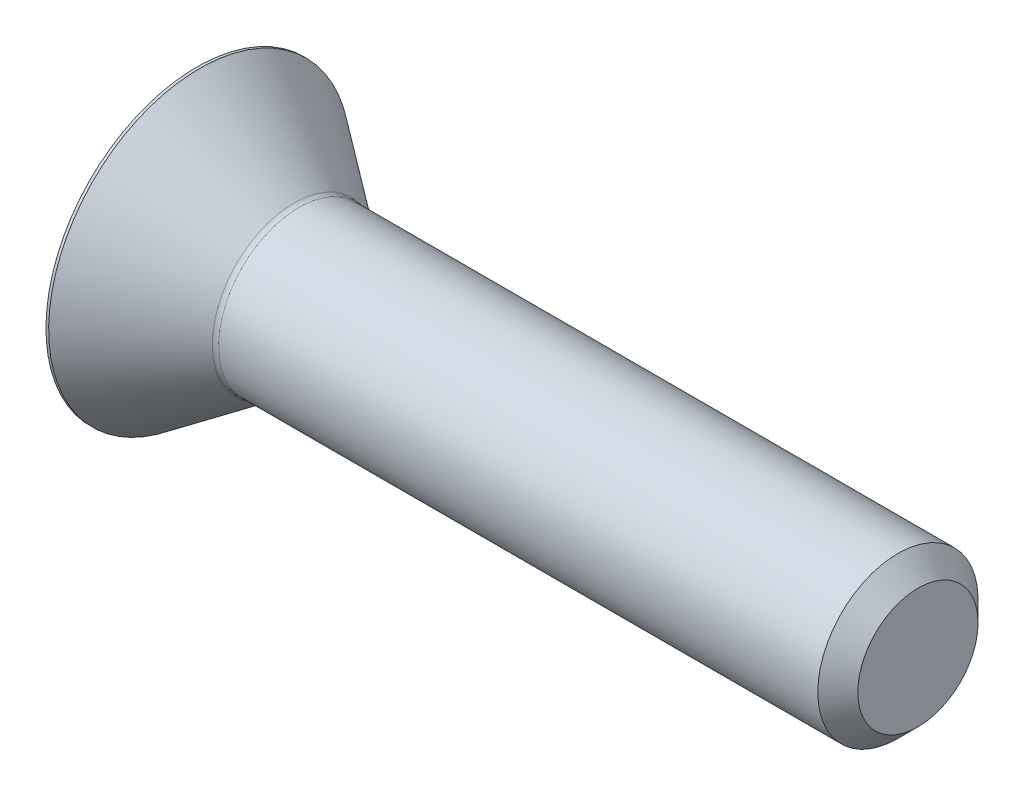
ISO-10303-21;
HEADER;
FILE_DESCRIPTION(('STEP AP214'),'2;1');
FILE_NAME('part.step','',(''),(''),'','','');
FILE_SCHEMA(('AUTOMOTIVE_DESIGN { 1 0 10303 214 1 1 1 1 }'));
ENDSEC;
DATA;
#1=APPLICATION_CONTEXT('core data for automotive mechanical design processes');
#2=APPLICATION_PROTOCOL_DEFINITION('international standard','automotive_design',2000,#1);
#3=PRODUCT_CONTEXT('',#1,'mechanical');
#4=PRODUCT('Part','Part','',(#3));
#5=PRODUCT_RELATED_PRODUCT_CATEGORY('part','',(#4));
#6=PRODUCT_DEFINITION_FORMATION('','',#4);
#7=PRODUCT_DEFINITION_CONTEXT('part definition',#1,'design');
#8=PRODUCT_DEFINITION('design','',#6,#7);
#9=PRODUCT_DEFINITION_SHAPE('','',#8);
#10=(LENGTH_UNIT() NAMED_UNIT(*) SI_UNIT(.MILLI.,.METRE.));
#11=(NAMED_UNIT(*) PLANE_ANGLE_UNIT() SI_UNIT($,.RADIAN.));
#12=(NAMED_UNIT(*) SI_UNIT($,.STERADIAN.) SOLID_ANGLE_UNIT());
#13=UNCERTAINTY_MEASURE_WITH_UNIT(LENGTH_MEASURE(1.E-05),#10,'distance_accuracy_value','');
#14=(GEOMETRIC_REPRESENTATION_CONTEXT(3) GLOBAL_UNCERTAINTY_ASSIGNED_CONTEXT((#13)) GLOBAL_UNIT_ASSIGNED_CONTEXT((#10,
#11,#12)) REPRESENTATION_CONTEXT('',''));
#15=CARTESIAN_POINT('',(0.,0.,0.));
#16=DIRECTION('',(0.,0.,1.));
#17=DIRECTION('',(1.,0.,0.));
#18=AXIS2_PLACEMENT_3D('',#15,#16,#17);
#19=CARTESIAN_POINT('',(1.50000000007822,0.,0.));
#20=DIRECTION('',(-1.,0.,0.));
#21=DIRECTION('',(0.,0.,1.));
#22=AXIS2_PLACEMENT_3D('',#19,#20,#21);
#23=CONICAL_SURFACE('',#22,1.43649999989748,1.04719755095507);
#24=CARTESIAN_POINT('',(2.32936366182912,0.,0.));
#25=VERTEX_POINT('',#24);
#26=VERTEX_LOOP('',#25);
#27=FACE_BOUND('',#26,.T.);
#28=CARTESIAN_POINT('',(1.50000000001258,0.,0.));
#29=DIRECTION('',(-1.,0.,0.));
#30=DIRECTION('',(0.,0.,1.));
#31=AXIS2_PLACEMENT_3D('',#28,#29,#30);
#32=CIRCLE('',#31,1.43650000001117);
#33=CARTESIAN_POINT('',(1.50000000001258,1.43650000001117,0.));
#34=VERTEX_POINT('',#33);
#35=CARTESIAN_POINT('',(1.50000000001258,0.718250000005584,-1.24404549254601));
#36=VERTEX_POINT('',#35);
#37=EDGE_CURVE('E133',#34,#36,#32,.T.);
#38=ORIENTED_EDGE('',*,*,#37,.T.);
#39=CARTESIAN_POINT('',(1.50000000001258,0.,0.));
#40=DIRECTION('',(-1.,0.,0.));
#41=DIRECTION('',(0.,0.,1.));
#42=AXIS2_PLACEMENT_3D('',#39,#40,#41);
#43=CIRCLE('',#42,1.43650000001116);
#44=CARTESIAN_POINT('',(1.50000000001258,-0.718250000005581,-1.24404549254602));
#45=VERTEX_POINT('',#44);
#46=EDGE_CURVE('E131',#36,#45,#43,.T.);
#47=ORIENTED_EDGE('',*,*,#46,.T.);
#48=CARTESIAN_POINT('',(1.50000000001258,0.,0.));
#49=DIRECTION('',(-1.,0.,0.));
#50=DIRECTION('',(0.,0.,1.));
#51=AXIS2_PLACEMENT_3D('',#48,#49,#50);
#52=CIRCLE('',#51,1.43650000001116);
#53=CARTESIAN_POINT('',(1.50000000001698,-1.43649999999987,-2.15376761564245E-13));
#54=VERTEX_POINT('',#53);
#55=EDGE_CURVE('E75',#45,#54,#52,.T.);
#56=ORIENTED_EDGE('',*,*,#55,.T.);
#57=CARTESIAN_POINT('',(1.50000000001258,0.,0.));
#58=DIRECTION('',(-1.,0.,0.));
#59=DIRECTION('',(0.,0.,1.));
#60=AXIS2_PLACEMENT_3D('',#57,#58,#59);
#61=CIRCLE('',#60,1.43650000001116);
#62=CARTESIAN_POINT('',(1.50000000001258,-0.718250000005582,1.24404549254602));
#63=VERTEX_POINT('',#62);
#64=EDGE_CURVE('E20',#54,#63,#61,.T.);
#65=ORIENTED_EDGE('',*,*,#64,.T.);
#66=CARTESIAN_POINT('',(1.50000000001258,0.,0.));
#67=DIRECTION('',(-1.,0.,0.));
#68=DIRECTION('',(0.,0.,1.));
#69=AXIS2_PLACEMENT_3D('',#66,#67,#68);
#70=CIRCLE('',#69,1.43650000001116);
#71=CARTESIAN_POINT('',(1.50000000001258,0.718250000005582,1.24404549254602));
#72=VERTEX_POINT('',#71);
#73=EDGE_CURVE('E72',#63,#72,#70,.T.);
#74=ORIENTED_EDGE('',*,*,#73,.T.);
#75=CARTESIAN_POINT('',(1.50000000001258,0.,0.));
#76=DIRECTION('',(-1.,0.,0.));
#77=DIRECTION('',(0.,0.,1.));
#78=AXIS2_PLACEMENT_3D('',#75,#76,#77);
#79=CIRCLE('',#78,1.43650000001116);
#80=EDGE_CURVE('E99',#72,#34,#79,.T.);
#81=ORIENTED_EDGE('',*,*,#80,.T.);
#82=EDGE_LOOP('',(#38,#47,#56,#65,#74,#81));
#83=FACE_BOUND('',#82,.T.);
#84=ADVANCED_FACE('F16',(#27,#83),#23,.F.);
#85=CARTESIAN_POINT('',(1.5,0.,0.));
#86=DIRECTION('',(-1.,0.,0.));
#87=DIRECTION('',(0.,-1.,0.));
#88=AXIS2_PLACEMENT_3D('',#85,#86,#87);
#89=PLANE('',#88);
#90=DIRECTION('',(0.,-0.5,-0.866025403784438));
#91=VECTOR('',#90,1.);
#92=CARTESIAN_POINT('',(1.50000000002137,-1.4365,0.));
#93=LINE('',#92,#91);
#94=EDGE_CURVE('E79',#54,#63,#93,.F.);
#95=ORIENTED_EDGE('',*,*,#94,.T.);
#96=ORIENTED_EDGE('',*,*,#64,.F.);
#97=EDGE_LOOP('',(#95,#96));
#98=FACE_BOUND('',#97,.T.);
#99=ADVANCED_FACE('F81',(#98),#89,.F.);
#100=CARTESIAN_POINT('',(1.5,0.,0.));
#101=DIRECTION('',(-1.,0.,0.));
#102=DIRECTION('',(0.,-1.,0.));
#103=AXIS2_PLACEMENT_3D('',#100,#101,#102);
#104=PLANE('',#103);
#105=DIRECTION('',(0.,-1.,0.));
#106=VECTOR('',#105,1.);
#107=CARTESIAN_POINT('',(1.50000000002137,-0.718249999999999,1.24404549253635));
#108=LINE('',#107,#106);
#109=EDGE_CURVE('E94',#63,#72,#108,.F.);
#110=ORIENTED_EDGE('',*,*,#109,.T.);
#111=ORIENTED_EDGE('',*,*,#73,.F.);
#112=EDGE_LOOP('',(#110,#111));
#113=FACE_BOUND('',#112,.T.);
#114=ADVANCED_FACE('F97',(#113),#104,.F.);
#115=CARTESIAN_POINT('',(1.5,0.,0.));
#116=DIRECTION('',(-1.,0.,0.));
#117=DIRECTION('',(0.,-1.,0.));
#118=AXIS2_PLACEMENT_3D('',#115,#116,#117);
#119=PLANE('',#118);
#120=DIRECTION('',(0.,-0.5,0.866025403784439));
#121=VECTOR('',#120,1.);
#122=CARTESIAN_POINT('',(1.50000000002137,0.71825,1.24404549253635));
#123=LINE('',#122,#121);
#124=EDGE_CURVE('E105',#72,#34,#123,.F.);
#125=ORIENTED_EDGE('',*,*,#124,.T.);
#126=ORIENTED_EDGE('',*,*,#80,.F.);
#127=EDGE_LOOP('',(#125,#126));
#128=FACE_BOUND('',#127,.T.);
#129=ADVANCED_FACE('F141',(#128),#119,.F.);
#130=CARTESIAN_POINT('',(1.5,0.,0.));
#131=DIRECTION('',(-1.,0.,0.));
#132=DIRECTION('',(0.,-1.,0.));
#133=AXIS2_PLACEMENT_3D('',#130,#131,#132);
#134=PLANE('',#133);
#135=DIRECTION('',(0.,0.499999999999999,0.866025403784439));
#136=VECTOR('',#135,1.);
#137=CARTESIAN_POINT('',(1.50000000002137,1.4365,0.));
#138=LINE('',#137,#136);
#139=EDGE_CURVE('E151',#34,#36,#138,.F.);
#140=ORIENTED_EDGE('',*,*,#139,.T.);
#141=ORIENTED_EDGE('',*,*,#37,.F.);
#142=EDGE_LOOP('',(#140,#141));
#143=FACE_BOUND('',#142,.T.);
#144=ADVANCED_FACE('F154',(#143),#134,.F.);
#145=CARTESIAN_POINT('',(1.5,0.,0.));
#146=DIRECTION('',(-1.,0.,0.));
#147=DIRECTION('',(0.,-1.,0.));
#148=AXIS2_PLACEMENT_3D('',#145,#146,#147);
#149=PLANE('',#148);
#150=DIRECTION('',(0.,1.,0.));
#151=VECTOR('',#150,1.);
#152=CARTESIAN_POINT('',(1.50000000002137,0.718250000000002,-1.24404549253635));
#153=LINE('',#152,#151);
#154=EDGE_CURVE('E160',#36,#45,#153,.F.);
#155=ORIENTED_EDGE('',*,*,#154,.T.);
#156=ORIENTED_EDGE('',*,*,#46,.F.);
#157=EDGE_LOOP('',(#155,#156));
#158=FACE_BOUND('',#157,.T.);
#159=ADVANCED_FACE('F313',(#158),#149,.F.);
#160=CARTESIAN_POINT('',(1.5,0.,0.));
#161=DIRECTION('',(-1.,0.,0.));
#162=DIRECTION('',(0.,-1.,0.));
#163=AXIS2_PLACEMENT_3D('',#160,#161,#162);
#164=PLANE('',#163);
#165=DIRECTION('',(0.,0.5,-0.866025403784439));
#166=VECTOR('',#165,1.);
#167=CARTESIAN_POINT('',(1.50000000002137,-0.718249999999998,-1.24404549253635));
#168=LINE('',#167,#166);
#169=EDGE_CURVE('E184',#45,#54,#168,.F.);
#170=ORIENTED_EDGE('',*,*,#169,.T.);
#171=ORIENTED_EDGE('',*,*,#55,.F.);
#172=EDGE_LOOP('',(#170,#171));
#173=FACE_BOUND('',#172,.T.);
#174=ADVANCED_FACE('F323',(#173),#164,.F.);
#175=CARTESIAN_POINT('',(1.5,-1.4365,0.));
#176=DIRECTION('',(0.,-0.866025403784438,0.5));
#177=DIRECTION('',(0.,-0.5,-0.866025403784438));
#178=AXIS2_PLACEMENT_3D('',#175,#176,#177);
#179=PLANE('',#178);
#180=ORIENTED_EDGE('',*,*,#94,.F.);
#181=DIRECTION('',(1.,0.,0.));
#182=VECTOR('',#181,1.);
#183=CARTESIAN_POINT('',(1.5,-1.43649999998858,-1.97751971048321E-11));
#184=LINE('',#183,#182);
#185=CARTESIAN_POINT('',(0.,-1.43649999999715,-4.94376005613724E-12));
#186=VERTEX_POINT('',#185);
#187=EDGE_CURVE('E118',#54,#186,#184,.F.);
#188=ORIENTED_EDGE('',*,*,#187,.T.);
#189=DIRECTION('',(0.,0.5,0.866025403784438));
#190=VECTOR('',#189,1.);
#191=CARTESIAN_POINT('',(0.,-1.4365,0.));
#192=LINE('',#191,#190);
#193=CARTESIAN_POINT('',(0.,-0.718250000002854,1.24404549253635));
#194=VERTEX_POINT('',#193);
#195=EDGE_CURVE('E90',#186,#194,#192,.T.);
#196=ORIENTED_EDGE('',*,*,#195,.T.);
#197=DIRECTION('',(1.,0.,0.));
#198=VECTOR('',#197,1.);
#199=CARTESIAN_POINT('',(1.5,-0.718249999999999,1.24404549253635));
#200=LINE('',#199,#198);
#201=EDGE_CURVE('E85',#194,#63,#200,.T.);
#202=ORIENTED_EDGE('',*,*,#201,.T.);
#203=EDGE_LOOP('',(#180,#188,#196,#202));
#204=FACE_BOUND('',#203,.T.);
#205=ADVANCED_FACE('F88',(#204),#179,.F.);
#206=CARTESIAN_POINT('',(1.5,-0.718249999999999,1.24404549253635));
#207=DIRECTION('',(0.,0.,1.));
#208=DIRECTION('',(0.,-1.,0.));
#209=AXIS2_PLACEMENT_3D('',#206,#207,#208);
#210=PLANE('',#209);
#211=ORIENTED_EDGE('',*,*,#109,.F.);
#212=ORIENTED_EDGE('',*,*,#201,.F.);
#213=DIRECTION('',(0.,1.,0.));
#214=VECTOR('',#213,1.);
#215=CARTESIAN_POINT('',(0.,1.4365,1.24404549253635));
#216=LINE('',#215,#214);
#217=CARTESIAN_POINT('',(0.,0.718249999998572,1.24404549253882));
#218=VERTEX_POINT('',#217);
#219=EDGE_CURVE('E110',#194,#218,#216,.T.);
#220=ORIENTED_EDGE('',*,*,#219,.T.);
#221=DIRECTION('',(1.,0.,0.));
#222=VECTOR('',#221,1.);
#223=CARTESIAN_POINT('',(1.5,0.71825,1.24404549253635));
#224=LINE('',#223,#222);
#225=EDGE_CURVE('E102',#218,#72,#224,.T.);
#226=ORIENTED_EDGE('',*,*,#225,.T.);
#227=EDGE_LOOP('',(#211,#212,#220,#226));
#228=FACE_BOUND('',#227,.T.);
#229=ADVANCED_FACE('F100',(#228),#210,.F.);
#230=CARTESIAN_POINT('',(1.5,0.71825,1.24404549253635));
#231=DIRECTION('',(0.,0.866025403784439,0.5));
#232=DIRECTION('',(0.,-0.5,0.866025403784439));
#233=AXIS2_PLACEMENT_3D('',#230,#231,#232);
#234=PLANE('',#233);
#235=ORIENTED_EDGE('',*,*,#124,.F.);
#236=ORIENTED_EDGE('',*,*,#225,.F.);
#237=DIRECTION('',(0.,0.5,-0.866025403784438));
#238=VECTOR('',#237,1.);
#239=CARTESIAN_POINT('',(0.,0.718249999999999,1.24404549253635));
#240=LINE('',#239,#238);
#241=CARTESIAN_POINT('',(0.,1.43650000000143,2.47277247753379E-12));
#242=VERTEX_POINT('',#241);
#243=EDGE_CURVE('E112',#218,#242,#240,.T.);
#244=ORIENTED_EDGE('',*,*,#243,.T.);
#245=DIRECTION('',(1.,0.,0.));
#246=VECTOR('',#245,1.);
#247=CARTESIAN_POINT('',(1.5,1.4365,0.));
#248=LINE('',#247,#246);
#249=EDGE_CURVE('E143',#242,#34,#248,.T.);
#250=ORIENTED_EDGE('',*,*,#249,.T.);
#251=EDGE_LOOP('',(#235,#236,#244,#250));
#252=FACE_BOUND('',#251,.T.);
#253=ADVANCED_FACE('F146',(#252),#234,.F.);
#254=CARTESIAN_POINT('',(1.5,1.4365,0.));
#255=DIRECTION('',(0.,0.866025403784439,-0.499999999999999));
#256=DIRECTION('',(0.,0.499999999999999,0.866025403784439));
#257=AXIS2_PLACEMENT_3D('',#254,#255,#256);
#258=PLANE('',#257);
#259=ORIENTED_EDGE('',*,*,#139,.F.);
#260=ORIENTED_EDGE('',*,*,#249,.F.);
#261=DIRECTION('',(0.,-0.499999999999999,-0.866025403784439));
#262=VECTOR('',#261,1.);
#263=CARTESIAN_POINT('',(0.,1.4365,0.));
#264=LINE('',#263,#262);
#265=CARTESIAN_POINT('',(0.,0.718250000002857,-1.24404549253635));
#266=VERTEX_POINT('',#265);
#267=EDGE_CURVE('E165',#242,#266,#264,.T.);
#268=ORIENTED_EDGE('',*,*,#267,.T.);
#269=DIRECTION('',(1.,0.,0.));
#270=VECTOR('',#269,1.);
#271=CARTESIAN_POINT('',(1.5,0.718250000000002,-1.24404549253635));
#272=LINE('',#271,#270);
#273=EDGE_CURVE('E157',#266,#36,#272,.T.);
#274=ORIENTED_EDGE('',*,*,#273,.T.);
#275=EDGE_LOOP('',(#259,#260,#268,#274));
#276=FACE_BOUND('',#275,.T.);
#277=ADVANCED_FACE('F156',(#276),#258,.F.);
#278=CARTESIAN_POINT('',(1.5,0.718250000000002,-1.24404549253635));
#279=DIRECTION('',(0.,0.,-1.));
#280=DIRECTION('',(0.,1.,0.));
#281=AXIS2_PLACEMENT_3D('',#278,#279,#280);
#282=PLANE('',#281);
#283=ORIENTED_EDGE('',*,*,#154,.F.);
#284=ORIENTED_EDGE('',*,*,#273,.F.);
#285=DIRECTION('',(0.,1.,0.));
#286=VECTOR('',#285,1.);
#287=CARTESIAN_POINT('',(0.,1.4365,-1.24404549253635));
#288=LINE('',#287,#286);
#289=CARTESIAN_POINT('',(0.,-0.718249999999998,-1.24404549253634));
#290=VERTEX_POINT('',#289);
#291=EDGE_CURVE('E35',#266,#290,#288,.F.);
#292=ORIENTED_EDGE('',*,*,#291,.T.);
#293=DIRECTION('',(1.,0.,0.));
#294=VECTOR('',#293,1.);
#295=CARTESIAN_POINT('',(1.5,-0.718249999999998,-1.24404549253634));
#296=LINE('',#295,#294);
#297=EDGE_CURVE('E183',#290,#45,#296,.T.);
#298=ORIENTED_EDGE('',*,*,#297,.T.);
#299=EDGE_LOOP('',(#283,#284,#292,#298));
#300=FACE_BOUND('',#299,.T.);
#301=ADVANCED_FACE('F371',(#300),#282,.F.);
#302=CARTESIAN_POINT('',(1.5,-0.718249999999998,-1.24404549253635));
#303=DIRECTION('',(0.,-0.866025403784439,-0.5));
#304=DIRECTION('',(0.,0.5,-0.866025403784439));
#305=AXIS2_PLACEMENT_3D('',#302,#303,#304);
#306=PLANE('',#305);
#307=ORIENTED_EDGE('',*,*,#169,.F.);
#308=ORIENTED_EDGE('',*,*,#297,.F.);
#309=DIRECTION('',(0.,-0.500000000000001,0.866025403784438));
#310=VECTOR('',#309,1.);
#311=CARTESIAN_POINT('',(0.,-0.718249999999999,-1.24404549253635));
#312=LINE('',#311,#310);
#313=EDGE_CURVE('E129',#290,#186,#312,.T.);
#314=ORIENTED_EDGE('',*,*,#313,.T.);
#315=ORIENTED_EDGE('',*,*,#187,.F.);
#316=EDGE_LOOP('',(#307,#308,#314,#315));
#317=FACE_BOUND('',#316,.T.);
#318=ADVANCED_FACE('F381',(#317),#306,.F.);
#319=CARTESIAN_POINT('',(0.,1.4365,0.));
#320=DIRECTION('',(1.,0.,0.));
#321=DIRECTION('',(0.,1.,0.));
#322=AXIS2_PLACEMENT_3D('',#319,#320,#321);
#323=PLANE('',#322);
#324=CARTESIAN_POINT('',(0.,0.,0.));
#325=DIRECTION('',(-1.,0.,0.));
#326=DIRECTION('',(0.,-1.,0.));
#327=AXIS2_PLACEMENT_3D('',#324,#325,#326);
#328=CIRCLE('',#327,3.765);
#329=CARTESIAN_POINT('',(0.,-3.765,0.));
#330=VERTEX_POINT('',#329);
#331=EDGE_CURVE('E126',#330,#330,#328,.F.);
#332=ORIENTED_EDGE('',*,*,#331,.F.);
#333=EDGE_LOOP('',(#332));
#334=FACE_BOUND('',#333,.T.);
#335=ORIENTED_EDGE('',*,*,#291,.F.);
#336=ORIENTED_EDGE('',*,*,#267,.F.);
#337=ORIENTED_EDGE('',*,*,#243,.F.);
#338=ORIENTED_EDGE('',*,*,#219,.F.);
#339=ORIENTED_EDGE('',*,*,#195,.F.);
#340=ORIENTED_EDGE('',*,*,#313,.F.);
#341=EDGE_LOOP('',(#335,#336,#337,#338,#339,#340));
#342=FACE_BOUND('',#341,.T.);
#343=ADVANCED_FACE('F217',(#334,#342),#323,.F.);
#344=CARTESIAN_POINT('',(2.32936366169089,0.,0.));
#345=DIRECTION('',(-1.,0.,0.));
#346=DIRECTION('',(0.,-1.,0.));
#347=AXIS2_PLACEMENT_3D('',#344,#345,#346);
#348=CYLINDRICAL_SURFACE('',#347,3.765);
#349=ORIENTED_EDGE('',*,*,#331,.T.);
#350=EDGE_LOOP('',(#349));
#351=FACE_BOUND('',#350,.T.);
#352=CARTESIAN_POINT('',(0.0669600000264836,0.,0.));
#353=DIRECTION('',(-1.,0.,0.));
#354=DIRECTION('',(0.,-1.,0.));
#355=AXIS2_PLACEMENT_3D('',#352,#353,#354);
#356=CIRCLE('',#355,3.76499999998714);
#357=CARTESIAN_POINT('',(0.0669600000264836,-3.76499999998714,0.));
#358=VERTEX_POINT('',#357);
#359=EDGE_CURVE('E125',#358,#358,#356,.F.);
#360=ORIENTED_EDGE('',*,*,#359,.F.);
#361=EDGE_LOOP('',(#360));
#362=FACE_BOUND('',#361,.T.);
#363=ADVANCED_FACE('F208',(#351,#362),#348,.T.);
#364=CARTESIAN_POINT('',(18.,0.,0.));
#365=DIRECTION('',(1.,0.,0.));
#366=DIRECTION('',(0.,1.,0.));
#367=AXIS2_PLACEMENT_3D('',#364,#365,#366);
#368=PLANE('',#367);
#369=CARTESIAN_POINT('',(18.0000000000859,0.,0.));
#370=DIRECTION('',(-1.,0.,0.));
#371=DIRECTION('',(0.,0.,1.));
#372=AXIS2_PLACEMENT_3D('',#369,#370,#371);
#373=CIRCLE('',#372,1.49999999996453);
#374=CARTESIAN_POINT('',(18.0000000000859,0.,1.49999999996453));
#375=VERTEX_POINT('',#374);
#376=EDGE_CURVE('E121',#375,#375,#373,.T.);
#377=ORIENTED_EDGE('',*,*,#376,.F.);
#378=EDGE_LOOP('',(#377));
#379=FACE_BOUND('',#378,.T.);
#380=ADVANCED_FACE('F206',(#379),#368,.T.);
#381=CARTESIAN_POINT('',(0.0669600000264836,0.,0.));
#382=DIRECTION('',(-1.,0.,0.));
#383=DIRECTION('',(0.,-1.,0.));
#384=AXIS2_PLACEMENT_3D('',#381,#382,#383);
#385=CONICAL_SURFACE('',#384,3.76499999998714,0.631518135003344);
#386=ORIENTED_EDGE('',*,*,#359,.T.);
#387=EDGE_LOOP('',(#386));
#388=FACE_BOUND('',#387,.T.);
#389=CARTESIAN_POINT('',(2.42726370838965,0.,0.));
#390=DIRECTION('',(-1.,0.,0.));
#391=DIRECTION('',(0.,0.,1.));
#392=AXIS2_PLACEMENT_3D('',#389,#390,#391);
#393=CIRCLE('',#392,2.03857356475328);
#394=CARTESIAN_POINT('',(2.42726370838965,0.,2.03857356475328));
#395=VERTEX_POINT('',#394);
#396=EDGE_CURVE('E124',#395,#395,#393,.T.);
#397=ORIENTED_EDGE('',*,*,#396,.T.);
#398=EDGE_LOOP('',(#397));
#399=FACE_BOUND('',#398,.T.);
#400=ADVANCED_FACE('F202',(#388,#399),#385,.T.);
#401=CARTESIAN_POINT('',(17.5000000000409,0.,0.));
#402=DIRECTION('',(-1.,0.,0.));
#403=DIRECTION('',(0.,0.,1.));
#404=AXIS2_PLACEMENT_3D('',#401,#402,#403);
#405=CONICAL_SURFACE('',#404,2.00000000000955,0.785398163397448);
#406=CARTESIAN_POINT('',(17.5,0.,0.));
#407=DIRECTION('',(-1.,0.,0.));
#408=DIRECTION('',(0.,-1.,0.));
#409=AXIS2_PLACEMENT_3D('',#406,#407,#408);
#410=CIRCLE('',#409,2.);
#411=CARTESIAN_POINT('',(17.5,-2.,0.));
#412=VERTEX_POINT('',#411);
#413=EDGE_CURVE('E26',#412,#412,#410,.T.);
#414=ORIENTED_EDGE('',*,*,#413,.F.);
#415=EDGE_LOOP('',(#414));
#416=FACE_BOUND('',#415,.T.);
#417=ORIENTED_EDGE('',*,*,#376,.T.);
#418=EDGE_LOOP('',(#417));
#419=FACE_BOUND('',#418,.T.);
#420=ADVANCED_FACE('F199',(#416,#419),#405,.T.);
#421=CARTESIAN_POINT('',(2.54533786307025,0.,0.));
#422=DIRECTION('',(-1.,0.,0.));
#423=DIRECTION('',(0.,0.,1.));
#424=AXIS2_PLACEMENT_3D('',#421,#422,#423);
#425=TOROIDAL_SURFACE('',#424,2.20000000000001,0.200000000000007);
#426=ORIENTED_EDGE('',*,*,#396,.F.);
#427=EDGE_LOOP('',(#426));
#428=FACE_BOUND('',#427,.T.);
#429=CARTESIAN_POINT('',(2.54533786307025,0.,0.));
#430=DIRECTION('',(-1.,0.,0.));
#431=DIRECTION('',(0.,-1.,0.));
#432=AXIS2_PLACEMENT_3D('',#429,#430,#431);
#433=CIRCLE('',#432,2.);
#434=CARTESIAN_POINT('',(2.54533786307025,-2.,0.));
#435=VERTEX_POINT('',#434);
#436=EDGE_CURVE('E11',#435,#435,#433,.F.);
#437=ORIENTED_EDGE('',*,*,#436,.F.);
#438=EDGE_LOOP('',(#437));
#439=FACE_BOUND('',#438,.T.);
#440=ADVANCED_FACE('F18',(#428,#439),#425,.F.);
#441=CARTESIAN_POINT('',(2.32936366169089,0.,0.));
#442=DIRECTION('',(-1.,0.,0.));
#443=DIRECTION('',(0.,-1.,0.));
#444=AXIS2_PLACEMENT_3D('',#441,#442,#443);
#445=CYLINDRICAL_SURFACE('',#444,2.);
#446=ORIENTED_EDGE('',*,*,#436,.T.);
#447=EDGE_LOOP('',(#446));
#448=FACE_BOUND('',#447,.T.);
#449=ORIENTED_EDGE('',*,*,#413,.T.);
#450=EDGE_LOOP('',(#449));
#451=FACE_BOUND('',#450,.T.);
#452=ADVANCED_FACE('F197',(#448,#451),#445,.T.);
#453=CLOSED_SHELL('',(#84,#99,#114,#129,#144,#159,#174,#205,#229,#253,#277,#301,#318,#343,#363,
#380,#400,#420,#440,#452));
#454=MANIFOLD_SOLID_BREP('B1',#453);
#455=ADVANCED_BREP_SHAPE_REPRESENTATION('',(#18,#454),#14);
#456=SHAPE_DEFINITION_REPRESENTATION(#9,#455);
ENDSEC;
END-ISO-10303-21;
